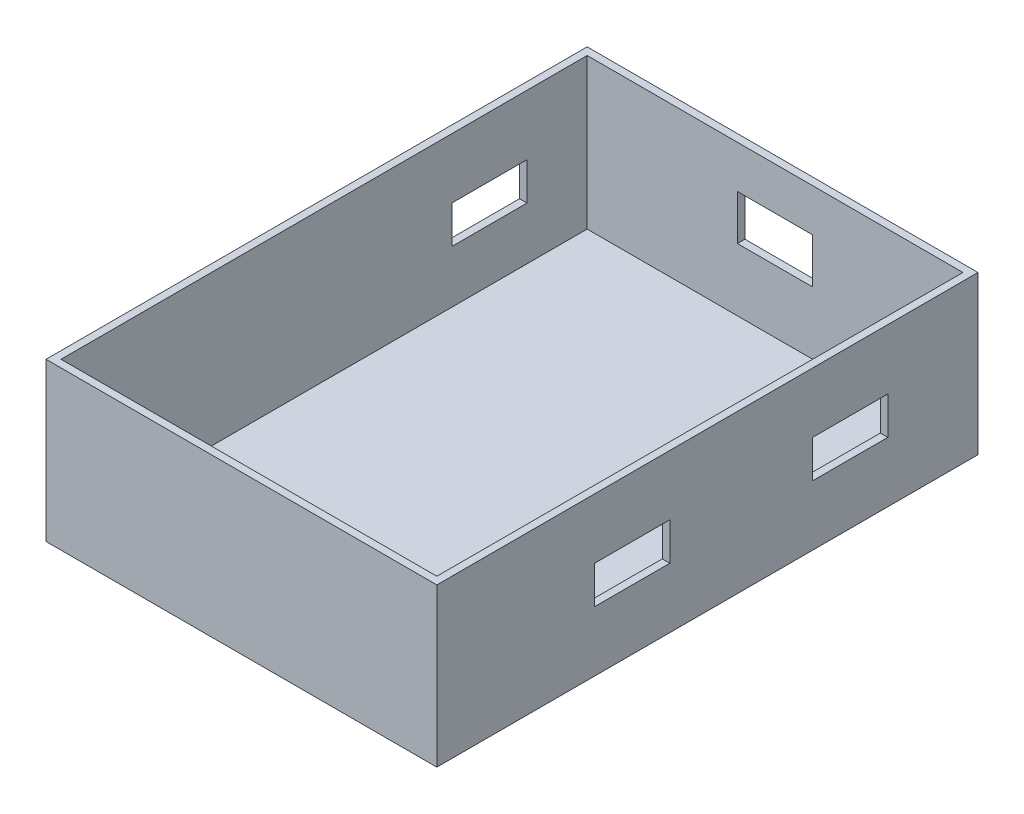
ISO-10303-21;
HEADER;
FILE_DESCRIPTION(('STEP AP214'),'2;1');
FILE_NAME('part.step','',(''),(''),'','','');
FILE_SCHEMA(('AUTOMOTIVE_DESIGN { 1 0 10303 214 1 1 1 1 }'));
ENDSEC;
DATA;
#1=APPLICATION_CONTEXT('core data for automotive mechanical design processes');
#2=APPLICATION_PROTOCOL_DEFINITION('international standard','automotive_design',2000,#1);
#3=PRODUCT_CONTEXT('',#1,'mechanical');
#4=PRODUCT('Part','Part','',(#3));
#5=PRODUCT_RELATED_PRODUCT_CATEGORY('part','',(#4));
#6=PRODUCT_DEFINITION_FORMATION('','',#4);
#7=PRODUCT_DEFINITION_CONTEXT('part definition',#1,'design');
#8=PRODUCT_DEFINITION('design','',#6,#7);
#9=PRODUCT_DEFINITION_SHAPE('','',#8);
#10=(LENGTH_UNIT() NAMED_UNIT(*) SI_UNIT(.MILLI.,.METRE.));
#11=(NAMED_UNIT(*) PLANE_ANGLE_UNIT() SI_UNIT($,.RADIAN.));
#12=(NAMED_UNIT(*) SI_UNIT($,.STERADIAN.) SOLID_ANGLE_UNIT());
#13=UNCERTAINTY_MEASURE_WITH_UNIT(LENGTH_MEASURE(1.E-05),#10,'distance_accuracy_value','');
#14=(GEOMETRIC_REPRESENTATION_CONTEXT(3) GLOBAL_UNCERTAINTY_ASSIGNED_CONTEXT((#13)) GLOBAL_UNIT_ASSIGNED_CONTEXT((#10,
#11,#12)) REPRESENTATION_CONTEXT('',''));
#15=CARTESIAN_POINT('',(0.,0.,0.));
#16=DIRECTION('',(0.,0.,1.));
#17=DIRECTION('',(1.,0.,0.));
#18=AXIS2_PLACEMENT_3D('',#15,#16,#17);
#19=CARTESIAN_POINT('',(-1.,21.,1.));
#20=DIRECTION('',(1.,0.,0.));
#21=DIRECTION('',(0.,0.,-1.));
#22=AXIS2_PLACEMENT_3D('',#19,#20,#21);
#23=PLANE('',#22);
#24=DIRECTION('',(0.,0.,1.));
#25=VECTOR('',#24,1.);
#26=CARTESIAN_POINT('',(-1.,0.,1.));
#27=LINE('',#26,#25);
#28=CARTESIAN_POINT('',(-1.,0.,-71.));
#29=VERTEX_POINT('',#28);
#30=CARTESIAN_POINT('',(-1.,0.,1.));
#31=VERTEX_POINT('',#30);
#32=EDGE_CURVE('E371',#29,#31,#27,.T.);
#33=ORIENTED_EDGE('',*,*,#32,.T.);
#34=DIRECTION('',(0.,-1.,0.));
#35=VECTOR('',#34,1.);
#36=CARTESIAN_POINT('',(-1.,21.,1.));
#37=LINE('',#36,#35);
#38=CARTESIAN_POINT('',(-1.,21.,1.));
#39=VERTEX_POINT('',#38);
#40=EDGE_CURVE('E409',#39,#31,#37,.T.);
#41=ORIENTED_EDGE('',*,*,#40,.F.);
#42=DIRECTION('',(0.,0.,1.));
#43=VECTOR('',#42,1.);
#44=CARTESIAN_POINT('',(-1.,21.,1.));
#45=LINE('',#44,#43);
#46=CARTESIAN_POINT('',(-1.,21.,-71.));
#47=VERTEX_POINT('',#46);
#48=EDGE_CURVE('E372',#47,#39,#45,.T.);
#49=ORIENTED_EDGE('',*,*,#48,.F.);
#50=DIRECTION('',(0.,-1.,0.));
#51=VECTOR('',#50,1.);
#52=CARTESIAN_POINT('',(-1.,21.,-71.));
#53=LINE('',#52,#51);
#54=EDGE_CURVE('E386',#47,#29,#53,.T.);
#55=ORIENTED_EDGE('',*,*,#54,.T.);
#56=EDGE_LOOP('',(#33,#41,#49,#55));
#57=FACE_BOUND('',#56,.T.);
#58=DIRECTION('',(0.,-1.,0.));
#59=VECTOR('',#58,1.);
#60=CARTESIAN_POINT('',(-1.,0.,-52.));
#61=LINE('',#60,#59);
#62=CARTESIAN_POINT('',(-1.,13.,-52.));
#63=VERTEX_POINT('',#62);
#64=CARTESIAN_POINT('',(-1.,8.,-52.));
#65=VERTEX_POINT('',#64);
#66=EDGE_CURVE('E237',#63,#65,#61,.T.);
#67=ORIENTED_EDGE('',*,*,#66,.T.);
#68=DIRECTION('',(0.,0.,1.));
#69=VECTOR('',#68,1.);
#70=CARTESIAN_POINT('',(-1.,8.,-62.));
#71=LINE('',#70,#69);
#72=CARTESIAN_POINT('',(-1.,8.,-62.));
#73=VERTEX_POINT('',#72);
#74=EDGE_CURVE('E252',#73,#65,#71,.T.);
#75=ORIENTED_EDGE('',*,*,#74,.F.);
#76=DIRECTION('',(0.,-1.,0.));
#77=VECTOR('',#76,1.);
#78=CARTESIAN_POINT('',(-1.,0.,-62.));
#79=LINE('',#78,#77);
#80=CARTESIAN_POINT('',(-1.,13.,-62.));
#81=VERTEX_POINT('',#80);
#82=EDGE_CURVE('E78',#81,#73,#79,.T.);
#83=ORIENTED_EDGE('',*,*,#82,.F.);
#84=DIRECTION('',(0.,0.,1.));
#85=VECTOR('',#84,1.);
#86=CARTESIAN_POINT('',(-1.,13.,0.));
#87=LINE('',#86,#85);
#88=EDGE_CURVE('E230',#81,#63,#87,.T.);
#89=ORIENTED_EDGE('',*,*,#88,.T.);
#90=EDGE_LOOP('',(#67,#75,#83,#89));
#91=FACE_BOUND('',#90,.T.);
#92=ADVANCED_FACE('F62',(#57,#91),#23,.F.);
#93=CARTESIAN_POINT('',(0.,21.,0.));
#94=DIRECTION('',(1.,0.,0.));
#95=DIRECTION('',(0.,0.,-1.));
#96=AXIS2_PLACEMENT_3D('',#93,#94,#95);
#97=PLANE('',#96);
#98=DIRECTION('',(0.,-1.,0.));
#99=VECTOR('',#98,1.);
#100=CARTESIAN_POINT('',(0.,21.,0.));
#101=LINE('',#100,#99);
#102=CARTESIAN_POINT('',(0.,21.,0.));
#103=VERTEX_POINT('',#102);
#104=CARTESIAN_POINT('',(0.,1.,0.));
#105=VERTEX_POINT('',#104);
#106=EDGE_CURVE('E367',#103,#105,#101,.T.);
#107=ORIENTED_EDGE('',*,*,#106,.T.);
#108=DIRECTION('',(0.,0.,-1.));
#109=VECTOR('',#108,1.);
#110=CARTESIAN_POINT('',(0.,1.,0.));
#111=LINE('',#110,#109);
#112=CARTESIAN_POINT('',(0.,1.,-70.));
#113=VERTEX_POINT('',#112);
#114=EDGE_CURVE('E423',#105,#113,#111,.T.);
#115=ORIENTED_EDGE('',*,*,#114,.T.);
#116=DIRECTION('',(0.,-1.,0.));
#117=VECTOR('',#116,1.);
#118=CARTESIAN_POINT('',(0.,21.,-70.));
#119=LINE('',#118,#117);
#120=CARTESIAN_POINT('',(0.,21.,-70.));
#121=VERTEX_POINT('',#120);
#122=EDGE_CURVE('E355',#121,#113,#119,.T.);
#123=ORIENTED_EDGE('',*,*,#122,.F.);
#124=DIRECTION('',(0.,0.,1.));
#125=VECTOR('',#124,1.);
#126=CARTESIAN_POINT('',(0.,21.,0.));
#127=LINE('',#126,#125);
#128=EDGE_CURVE('E333',#121,#103,#127,.T.);
#129=ORIENTED_EDGE('',*,*,#128,.T.);
#130=EDGE_LOOP('',(#107,#115,#123,#129));
#131=FACE_BOUND('',#130,.T.);
#132=DIRECTION('',(0.,0.,-1.));
#133=VECTOR('',#132,1.);
#134=CARTESIAN_POINT('',(0.,8.,0.));
#135=LINE('',#134,#133);
#136=CARTESIAN_POINT('',(0.,8.,-52.));
#137=VERTEX_POINT('',#136);
#138=CARTESIAN_POINT('',(0.,8.,-62.));
#139=VERTEX_POINT('',#138);
#140=EDGE_CURVE('E469',#137,#139,#135,.T.);
#141=ORIENTED_EDGE('',*,*,#140,.F.);
#142=DIRECTION('',(0.,1.,0.));
#143=VECTOR('',#142,1.);
#144=CARTESIAN_POINT('',(0.,21.,-52.));
#145=LINE('',#144,#143);
#146=CARTESIAN_POINT('',(0.,13.,-52.));
#147=VERTEX_POINT('',#146);
#148=EDGE_CURVE('E12',#137,#147,#145,.T.);
#149=ORIENTED_EDGE('',*,*,#148,.T.);
#150=DIRECTION('',(0.,0.,-1.));
#151=VECTOR('',#150,1.);
#152=CARTESIAN_POINT('',(0.,13.,0.));
#153=LINE('',#152,#151);
#154=CARTESIAN_POINT('',(0.,13.,-62.));
#155=VERTEX_POINT('',#154);
#156=EDGE_CURVE('E71',#147,#155,#153,.T.);
#157=ORIENTED_EDGE('',*,*,#156,.T.);
#158=DIRECTION('',(0.,1.,0.));
#159=VECTOR('',#158,1.);
#160=CARTESIAN_POINT('',(0.,21.,-62.));
#161=LINE('',#160,#159);
#162=EDGE_CURVE('E472',#139,#155,#161,.T.);
#163=ORIENTED_EDGE('',*,*,#162,.F.);
#164=EDGE_LOOP('',(#141,#149,#157,#163));
#165=FACE_BOUND('',#164,.T.);
#166=ADVANCED_FACE('F478',(#131,#165),#97,.T.);
#167=CARTESIAN_POINT('',(0.,1.,0.));
#168=DIRECTION('',(0.,1.,0.));
#169=DIRECTION('',(0.,0.,1.));
#170=AXIS2_PLACEMENT_3D('',#167,#168,#169);
#171=PLANE('',#170);
#172=DIRECTION('',(1.,0.,0.));
#173=VECTOR('',#172,1.);
#174=CARTESIAN_POINT('',(0.,1.,-70.));
#175=LINE('',#174,#173);
#176=CARTESIAN_POINT('',(50.,1.00000000000001,-70.));
#177=VERTEX_POINT('',#176);
#178=EDGE_CURVE('E413',#113,#177,#175,.T.);
#179=ORIENTED_EDGE('',*,*,#178,.F.);
#180=ORIENTED_EDGE('',*,*,#114,.F.);
#181=DIRECTION('',(1.,0.,0.));
#182=VECTOR('',#181,1.);
#183=CARTESIAN_POINT('',(0.,1.,0.));
#184=LINE('',#183,#182);
#185=CARTESIAN_POINT('',(50.,1.,0.));
#186=VERTEX_POINT('',#185);
#187=EDGE_CURVE('E420',#105,#186,#184,.T.);
#188=ORIENTED_EDGE('',*,*,#187,.T.);
#189=DIRECTION('',(0.,0.,-1.));
#190=VECTOR('',#189,1.);
#191=CARTESIAN_POINT('',(50.,1.,0.));
#192=LINE('',#191,#190);
#193=EDGE_CURVE('E417',#186,#177,#192,.T.);
#194=ORIENTED_EDGE('',*,*,#193,.T.);
#195=EDGE_LOOP('',(#179,#180,#188,#194));
#196=FACE_BOUND('',#195,.T.);
#197=ADVANCED_FACE('F496',(#196),#171,.T.);
#198=CARTESIAN_POINT('',(0.,21.,0.));
#199=DIRECTION('',(0.,-1.,0.));
#200=DIRECTION('',(0.,0.,-1.));
#201=AXIS2_PLACEMENT_3D('',#198,#199,#200);
#202=PLANE('',#201);
#203=ORIENTED_EDGE('',*,*,#48,.T.);
#204=DIRECTION('',(1.,0.,0.));
#205=VECTOR('',#204,1.);
#206=CARTESIAN_POINT('',(-1.,21.,1.));
#207=LINE('',#206,#205);
#208=CARTESIAN_POINT('',(51.,21.,1.));
#209=VERTEX_POINT('',#208);
#210=EDGE_CURVE('E376',#39,#209,#207,.T.);
#211=ORIENTED_EDGE('',*,*,#210,.T.);
#212=DIRECTION('',(0.,0.,-1.));
#213=VECTOR('',#212,1.);
#214=CARTESIAN_POINT('',(51.,21.,1.));
#215=LINE('',#214,#213);
#216=CARTESIAN_POINT('',(51.,21.,-71.));
#217=VERTEX_POINT('',#216);
#218=EDGE_CURVE('E380',#209,#217,#215,.T.);
#219=ORIENTED_EDGE('',*,*,#218,.T.);
#220=DIRECTION('',(-1.,0.,0.));
#221=VECTOR('',#220,1.);
#222=CARTESIAN_POINT('',(-1.,21.,-71.));
#223=LINE('',#222,#221);
#224=EDGE_CURVE('E383',#217,#47,#223,.T.);
#225=ORIENTED_EDGE('',*,*,#224,.T.);
#226=EDGE_LOOP('',(#203,#211,#219,#225));
#227=FACE_BOUND('',#226,.T.);
#228=ORIENTED_EDGE('',*,*,#128,.F.);
#229=DIRECTION('',(-1.,0.,0.));
#230=VECTOR('',#229,1.);
#231=CARTESIAN_POINT('',(0.,21.,-70.));
#232=LINE('',#231,#230);
#233=CARTESIAN_POINT('',(50.,21.,-70.));
#234=VERTEX_POINT('',#233);
#235=EDGE_CURVE('E352',#234,#121,#232,.T.);
#236=ORIENTED_EDGE('',*,*,#235,.F.);
#237=DIRECTION('',(0.,0.,-1.));
#238=VECTOR('',#237,1.);
#239=CARTESIAN_POINT('',(50.,21.,0.));
#240=LINE('',#239,#238);
#241=CARTESIAN_POINT('',(50.,21.,0.));
#242=VERTEX_POINT('',#241);
#243=EDGE_CURVE('E348',#242,#234,#240,.T.);
#244=ORIENTED_EDGE('',*,*,#243,.F.);
#245=DIRECTION('',(1.,0.,0.));
#246=VECTOR('',#245,1.);
#247=CARTESIAN_POINT('',(0.,21.,0.));
#248=LINE('',#247,#246);
#249=EDGE_CURVE('E345',#103,#242,#248,.T.);
#250=ORIENTED_EDGE('',*,*,#249,.F.);
#251=EDGE_LOOP('',(#228,#236,#244,#250));
#252=FACE_BOUND('',#251,.T.);
#253=ADVANCED_FACE('F503',(#227,#252),#202,.F.);
#254=CARTESIAN_POINT('',(-1.,21.,1.));
#255=DIRECTION('',(0.,0.,-1.));
#256=DIRECTION('',(-1.,0.,0.));
#257=AXIS2_PLACEMENT_3D('',#254,#255,#256);
#258=PLANE('',#257);
#259=DIRECTION('',(1.,0.,0.));
#260=VECTOR('',#259,1.);
#261=CARTESIAN_POINT('',(-1.,0.,1.));
#262=LINE('',#261,#260);
#263=CARTESIAN_POINT('',(51.,0.,1.));
#264=VERTEX_POINT('',#263);
#265=EDGE_CURVE('E390',#31,#264,#262,.T.);
#266=ORIENTED_EDGE('',*,*,#265,.T.);
#267=DIRECTION('',(0.,-1.,0.));
#268=VECTOR('',#267,1.);
#269=CARTESIAN_POINT('',(51.,21.,1.));
#270=LINE('',#269,#268);
#271=EDGE_CURVE('E405',#209,#264,#270,.T.);
#272=ORIENTED_EDGE('',*,*,#271,.F.);
#273=ORIENTED_EDGE('',*,*,#210,.F.);
#274=ORIENTED_EDGE('',*,*,#40,.T.);
#275=EDGE_LOOP('',(#266,#272,#273,#274));
#276=FACE_BOUND('',#275,.T.);
#277=ADVANCED_FACE('F500',(#276),#258,.F.);
#278=CARTESIAN_POINT('',(51.,21.,1.));
#279=DIRECTION('',(-1.,0.,0.));
#280=DIRECTION('',(0.,0.,1.));
#281=AXIS2_PLACEMENT_3D('',#278,#279,#280);
#282=PLANE('',#281);
#283=DIRECTION('',(0.,1.,0.));
#284=VECTOR('',#283,1.);
#285=CARTESIAN_POINT('',(51.,0.,-30.));
#286=LINE('',#285,#284);
#287=CARTESIAN_POINT('',(51.,8.,-30.));
#288=VERTEX_POINT('',#287);
#289=CARTESIAN_POINT('',(51.,13.,-30.));
#290=VERTEX_POINT('',#289);
#291=EDGE_CURVE('E262',#288,#290,#286,.T.);
#292=ORIENTED_EDGE('',*,*,#291,.F.);
#293=DIRECTION('',(0.,0.,-1.));
#294=VECTOR('',#293,1.);
#295=CARTESIAN_POINT('',(51.,8.,0.));
#296=LINE('',#295,#294);
#297=CARTESIAN_POINT('',(51.,8.,-20.));
#298=VERTEX_POINT('',#297);
#299=EDGE_CURVE('E259',#298,#288,#296,.T.);
#300=ORIENTED_EDGE('',*,*,#299,.F.);
#301=DIRECTION('',(0.,1.,0.));
#302=VECTOR('',#301,1.);
#303=CARTESIAN_POINT('',(51.,0.,-20.));
#304=LINE('',#303,#302);
#305=CARTESIAN_POINT('',(51.,13.,-20.));
#306=VERTEX_POINT('',#305);
#307=EDGE_CURVE('E271',#298,#306,#304,.T.);
#308=ORIENTED_EDGE('',*,*,#307,.T.);
#309=DIRECTION('',(0.,0.,-1.));
#310=VECTOR('',#309,1.);
#311=CARTESIAN_POINT('',(51.,13.,0.));
#312=LINE('',#311,#310);
#313=EDGE_CURVE('E267',#306,#290,#312,.T.);
#314=ORIENTED_EDGE('',*,*,#313,.T.);
#315=EDGE_LOOP('',(#292,#300,#308,#314));
#316=FACE_BOUND('',#315,.T.);
#317=DIRECTION('',(0.,1.,0.));
#318=VECTOR('',#317,1.);
#319=CARTESIAN_POINT('',(51.,0.,-59.));
#320=LINE('',#319,#318);
#321=CARTESIAN_POINT('',(51.,8.00000000000001,-59.));
#322=VERTEX_POINT('',#321);
#323=CARTESIAN_POINT('',(51.,13.,-59.));
#324=VERTEX_POINT('',#323);
#325=EDGE_CURVE('E291',#322,#324,#320,.T.);
#326=ORIENTED_EDGE('',*,*,#325,.F.);
#327=DIRECTION('',(0.,0.,-1.));
#328=VECTOR('',#327,1.);
#329=CARTESIAN_POINT('',(51.,8.00000000000001,0.));
#330=LINE('',#329,#328);
#331=CARTESIAN_POINT('',(51.,8.00000000000001,-49.));
#332=VERTEX_POINT('',#331);
#333=EDGE_CURVE('E250',#332,#322,#330,.T.);
#334=ORIENTED_EDGE('',*,*,#333,.F.);
#335=DIRECTION('',(0.,1.,0.));
#336=VECTOR('',#335,1.);
#337=CARTESIAN_POINT('',(51.,0.,-49.));
#338=LINE('',#337,#336);
#339=CARTESIAN_POINT('',(51.,13.,-49.));
#340=VERTEX_POINT('',#339);
#341=EDGE_CURVE('E299',#332,#340,#338,.T.);
#342=ORIENTED_EDGE('',*,*,#341,.T.);
#343=DIRECTION('',(0.,0.,-1.));
#344=VECTOR('',#343,1.);
#345=CARTESIAN_POINT('',(51.,13.,0.));
#346=LINE('',#345,#344);
#347=EDGE_CURVE('E295',#340,#324,#346,.T.);
#348=ORIENTED_EDGE('',*,*,#347,.T.);
#349=EDGE_LOOP('',(#326,#334,#342,#348));
#350=FACE_BOUND('',#349,.T.);
#351=DIRECTION('',(0.,0.,-1.));
#352=VECTOR('',#351,1.);
#353=CARTESIAN_POINT('',(51.,0.,1.));
#354=LINE('',#353,#352);
#355=CARTESIAN_POINT('',(51.,0.,-71.));
#356=VERTEX_POINT('',#355);
#357=EDGE_CURVE('E393',#264,#356,#354,.T.);
#358=ORIENTED_EDGE('',*,*,#357,.T.);
#359=DIRECTION('',(0.,-1.,0.));
#360=VECTOR('',#359,1.);
#361=CARTESIAN_POINT('',(51.,21.,-71.));
#362=LINE('',#361,#360);
#363=EDGE_CURVE('E401',#217,#356,#362,.T.);
#364=ORIENTED_EDGE('',*,*,#363,.F.);
#365=ORIENTED_EDGE('',*,*,#218,.F.);
#366=ORIENTED_EDGE('',*,*,#271,.T.);
#367=EDGE_LOOP('',(#358,#364,#365,#366));
#368=FACE_BOUND('',#367,.T.);
#369=ADVANCED_FACE('F544',(#316,#350,#368),#282,.F.);
#370=CARTESIAN_POINT('',(-1.,21.,-71.));
#371=DIRECTION('',(0.,0.,1.));
#372=DIRECTION('',(1.,0.,0.));
#373=AXIS2_PLACEMENT_3D('',#370,#371,#372);
#374=PLANE('',#373);
#375=DIRECTION('',(-1.,0.,0.));
#376=VECTOR('',#375,1.);
#377=CARTESIAN_POINT('',(0.,9.33,-71.));
#378=LINE('',#377,#376);
#379=CARTESIAN_POINT('',(30.,9.33,-71.));
#380=VERTEX_POINT('',#379);
#381=CARTESIAN_POINT('',(20.,9.33,-71.));
#382=VERTEX_POINT('',#381);
#383=EDGE_CURVE('E317',#380,#382,#378,.T.);
#384=ORIENTED_EDGE('',*,*,#383,.F.);
#385=DIRECTION('',(0.,-1.,0.));
#386=VECTOR('',#385,1.);
#387=CARTESIAN_POINT('',(30.,0.,-71.));
#388=LINE('',#387,#386);
#389=CARTESIAN_POINT('',(30.,15.33,-71.));
#390=VERTEX_POINT('',#389);
#391=EDGE_CURVE('E279',#390,#380,#388,.T.);
#392=ORIENTED_EDGE('',*,*,#391,.F.);
#393=DIRECTION('',(-1.,0.,0.));
#394=VECTOR('',#393,1.);
#395=CARTESIAN_POINT('',(0.,15.33,-71.));
#396=LINE('',#395,#394);
#397=CARTESIAN_POINT('',(20.,15.33,-71.));
#398=VERTEX_POINT('',#397);
#399=EDGE_CURVE('E325',#390,#398,#396,.T.);
#400=ORIENTED_EDGE('',*,*,#399,.T.);
#401=DIRECTION('',(0.,-1.,0.));
#402=VECTOR('',#401,1.);
#403=CARTESIAN_POINT('',(20.,0.,-71.));
#404=LINE('',#403,#402);
#405=EDGE_CURVE('E321',#398,#382,#404,.T.);
#406=ORIENTED_EDGE('',*,*,#405,.T.);
#407=EDGE_LOOP('',(#384,#392,#400,#406));
#408=FACE_BOUND('',#407,.T.);
#409=DIRECTION('',(-1.,0.,0.));
#410=VECTOR('',#409,1.);
#411=CARTESIAN_POINT('',(-1.,0.,-71.));
#412=LINE('',#411,#410);
#413=EDGE_CURVE('E377',#356,#29,#412,.T.);
#414=ORIENTED_EDGE('',*,*,#413,.T.);
#415=ORIENTED_EDGE('',*,*,#54,.F.);
#416=ORIENTED_EDGE('',*,*,#224,.F.);
#417=ORIENTED_EDGE('',*,*,#363,.T.);
#418=EDGE_LOOP('',(#414,#415,#416,#417));
#419=FACE_BOUND('',#418,.T.);
#420=ADVANCED_FACE('F537',(#408,#419),#374,.F.);
#421=CARTESIAN_POINT('',(0.,21.,0.));
#422=DIRECTION('',(0.,0.,-1.));
#423=DIRECTION('',(-1.,0.,0.));
#424=AXIS2_PLACEMENT_3D('',#421,#422,#423);
#425=PLANE('',#424);
#426=DIRECTION('',(0.,-1.,0.));
#427=VECTOR('',#426,1.);
#428=CARTESIAN_POINT('',(50.,21.,0.));
#429=LINE('',#428,#427);
#430=EDGE_CURVE('E363',#242,#186,#429,.T.);
#431=ORIENTED_EDGE('',*,*,#430,.T.);
#432=ORIENTED_EDGE('',*,*,#187,.F.);
#433=ORIENTED_EDGE('',*,*,#106,.F.);
#434=ORIENTED_EDGE('',*,*,#249,.T.);
#435=EDGE_LOOP('',(#431,#432,#433,#434));
#436=FACE_BOUND('',#435,.T.);
#437=ADVANCED_FACE('F522',(#436),#425,.T.);
#438=CARTESIAN_POINT('',(50.,21.,0.));
#439=DIRECTION('',(-1.,0.,0.));
#440=DIRECTION('',(0.,0.,1.));
#441=AXIS2_PLACEMENT_3D('',#438,#439,#440);
#442=PLANE('',#441);
#443=DIRECTION('',(0.,0.,1.));
#444=VECTOR('',#443,1.);
#445=CARTESIAN_POINT('',(50.,8.,0.));
#446=LINE('',#445,#444);
#447=CARTESIAN_POINT('',(50.,8.,-30.));
#448=VERTEX_POINT('',#447);
#449=CARTESIAN_POINT('',(50.,8.,-20.));
#450=VERTEX_POINT('',#449);
#451=EDGE_CURVE('E466',#448,#450,#446,.T.);
#452=ORIENTED_EDGE('',*,*,#451,.F.);
#453=DIRECTION('',(0.,-1.,0.));
#454=VECTOR('',#453,1.);
#455=CARTESIAN_POINT('',(50.,21.,-30.));
#456=LINE('',#455,#454);
#457=CARTESIAN_POINT('',(50.,13.,-30.));
#458=VERTEX_POINT('',#457);
#459=EDGE_CURVE('E455',#458,#448,#456,.T.);
#460=ORIENTED_EDGE('',*,*,#459,.F.);
#461=DIRECTION('',(0.,0.,1.));
#462=VECTOR('',#461,1.);
#463=CARTESIAN_POINT('',(50.,13.,0.));
#464=LINE('',#463,#462);
#465=CARTESIAN_POINT('',(50.,13.,-20.));
#466=VERTEX_POINT('',#465);
#467=EDGE_CURVE('E458',#458,#466,#464,.T.);
#468=ORIENTED_EDGE('',*,*,#467,.T.);
#469=DIRECTION('',(0.,-1.,0.));
#470=VECTOR('',#469,1.);
#471=CARTESIAN_POINT('',(50.,21.,-20.));
#472=LINE('',#471,#470);
#473=EDGE_CURVE('E462',#466,#450,#472,.T.);
#474=ORIENTED_EDGE('',*,*,#473,.T.);
#475=EDGE_LOOP('',(#452,#460,#468,#474));
#476=FACE_BOUND('',#475,.T.);
#477=DIRECTION('',(0.,0.,1.));
#478=VECTOR('',#477,1.);
#479=CARTESIAN_POINT('',(50.,8.00000000000001,0.));
#480=LINE('',#479,#478);
#481=CARTESIAN_POINT('',(50.,8.00000000000001,-59.));
#482=VERTEX_POINT('',#481);
#483=CARTESIAN_POINT('',(50.,8.00000000000001,-49.));
#484=VERTEX_POINT('',#483);
#485=EDGE_CURVE('E452',#482,#484,#480,.T.);
#486=ORIENTED_EDGE('',*,*,#485,.F.);
#487=DIRECTION('',(0.,-1.,0.));
#488=VECTOR('',#487,1.);
#489=CARTESIAN_POINT('',(50.,21.,-59.));
#490=LINE('',#489,#488);
#491=CARTESIAN_POINT('',(50.,13.,-59.));
#492=VERTEX_POINT('',#491);
#493=EDGE_CURVE('E441',#492,#482,#490,.T.);
#494=ORIENTED_EDGE('',*,*,#493,.F.);
#495=DIRECTION('',(0.,0.,1.));
#496=VECTOR('',#495,1.);
#497=CARTESIAN_POINT('',(50.,13.,0.));
#498=LINE('',#497,#496);
#499=CARTESIAN_POINT('',(50.,13.,-49.));
#500=VERTEX_POINT('',#499);
#501=EDGE_CURVE('E444',#492,#500,#498,.T.);
#502=ORIENTED_EDGE('',*,*,#501,.T.);
#503=DIRECTION('',(0.,-1.,0.));
#504=VECTOR('',#503,1.);
#505=CARTESIAN_POINT('',(50.,21.,-49.));
#506=LINE('',#505,#504);
#507=EDGE_CURVE('E448',#500,#484,#506,.T.);
#508=ORIENTED_EDGE('',*,*,#507,.T.);
#509=EDGE_LOOP('',(#486,#494,#502,#508));
#510=FACE_BOUND('',#509,.T.);
#511=DIRECTION('',(0.,-1.,0.));
#512=VECTOR('',#511,1.);
#513=CARTESIAN_POINT('',(50.,21.,-70.));
#514=LINE('',#513,#512);
#515=EDGE_CURVE('E359',#234,#177,#514,.T.);
#516=ORIENTED_EDGE('',*,*,#515,.T.);
#517=ORIENTED_EDGE('',*,*,#193,.F.);
#518=ORIENTED_EDGE('',*,*,#430,.F.);
#519=ORIENTED_EDGE('',*,*,#243,.T.);
#520=EDGE_LOOP('',(#516,#517,#518,#519));
#521=FACE_BOUND('',#520,.T.);
#522=ADVANCED_FACE('F525',(#476,#510,#521),#442,.T.);
#523=CARTESIAN_POINT('',(0.,21.,-70.));
#524=DIRECTION('',(0.,0.,1.));
#525=DIRECTION('',(1.,0.,0.));
#526=AXIS2_PLACEMENT_3D('',#523,#524,#525);
#527=PLANE('',#526);
#528=DIRECTION('',(0.,1.,0.));
#529=VECTOR('',#528,1.);
#530=CARTESIAN_POINT('',(30.,21.,-70.));
#531=LINE('',#530,#529);
#532=CARTESIAN_POINT('',(30.,9.33,-70.));
#533=VERTEX_POINT('',#532);
#534=CARTESIAN_POINT('',(30.,15.33,-70.));
#535=VERTEX_POINT('',#534);
#536=EDGE_CURVE('E438',#533,#535,#531,.T.);
#537=ORIENTED_EDGE('',*,*,#536,.F.);
#538=DIRECTION('',(1.,0.,0.));
#539=VECTOR('',#538,1.);
#540=CARTESIAN_POINT('',(0.,9.33,-70.));
#541=LINE('',#540,#539);
#542=CARTESIAN_POINT('',(20.,9.33,-70.));
#543=VERTEX_POINT('',#542);
#544=EDGE_CURVE('E427',#543,#533,#541,.T.);
#545=ORIENTED_EDGE('',*,*,#544,.F.);
#546=DIRECTION('',(0.,1.,0.));
#547=VECTOR('',#546,1.);
#548=CARTESIAN_POINT('',(20.,21.,-70.));
#549=LINE('',#548,#547);
#550=CARTESIAN_POINT('',(20.,15.33,-70.));
#551=VERTEX_POINT('',#550);
#552=EDGE_CURVE('E430',#543,#551,#549,.T.);
#553=ORIENTED_EDGE('',*,*,#552,.T.);
#554=DIRECTION('',(1.,0.,0.));
#555=VECTOR('',#554,1.);
#556=CARTESIAN_POINT('',(0.,15.33,-70.));
#557=LINE('',#556,#555);
#558=EDGE_CURVE('E434',#551,#535,#557,.T.);
#559=ORIENTED_EDGE('',*,*,#558,.T.);
#560=EDGE_LOOP('',(#537,#545,#553,#559));
#561=FACE_BOUND('',#560,.T.);
#562=ORIENTED_EDGE('',*,*,#122,.T.);
#563=ORIENTED_EDGE('',*,*,#178,.T.);
#564=ORIENTED_EDGE('',*,*,#515,.F.);
#565=ORIENTED_EDGE('',*,*,#235,.T.);
#566=EDGE_LOOP('',(#562,#563,#564,#565));
#567=FACE_BOUND('',#566,.T.);
#568=ADVANCED_FACE('F516',(#561,#567),#527,.T.);
#569=CARTESIAN_POINT('',(0.,0.,0.));
#570=DIRECTION('',(0.,1.,0.));
#571=DIRECTION('',(0.,0.,1.));
#572=AXIS2_PLACEMENT_3D('',#569,#570,#571);
#573=PLANE('',#572);
#574=ORIENTED_EDGE('',*,*,#32,.F.);
#575=ORIENTED_EDGE('',*,*,#413,.F.);
#576=ORIENTED_EDGE('',*,*,#357,.F.);
#577=ORIENTED_EDGE('',*,*,#265,.F.);
#578=EDGE_LOOP('',(#574,#575,#576,#577));
#579=FACE_BOUND('',#578,.T.);
#580=ADVANCED_FACE('F64',(#579),#573,.F.);
#581=CARTESIAN_POINT('',(30.,0.,-50.));
#582=DIRECTION('',(1.,0.,0.));
#583=DIRECTION('',(0.,0.,-1.));
#584=AXIS2_PLACEMENT_3D('',#581,#582,#583);
#585=PLANE('',#584);
#586=ORIENTED_EDGE('',*,*,#536,.T.);
#587=DIRECTION('',(0.,0.,-1.));
#588=VECTOR('',#587,1.);
#589=CARTESIAN_POINT('',(30.,15.33,-50.));
#590=LINE('',#589,#588);
#591=EDGE_CURVE('E330',#535,#390,#590,.T.);
#592=ORIENTED_EDGE('',*,*,#591,.T.);
#593=ORIENTED_EDGE('',*,*,#391,.T.);
#594=DIRECTION('',(0.,0.,-1.));
#595=VECTOR('',#594,1.);
#596=CARTESIAN_POINT('',(30.,9.33,-50.));
#597=LINE('',#596,#595);
#598=EDGE_CURVE('E329',#533,#380,#597,.T.);
#599=ORIENTED_EDGE('',*,*,#598,.F.);
#600=EDGE_LOOP('',(#586,#592,#593,#599));
#601=FACE_BOUND('',#600,.T.);
#602=ADVANCED_FACE('F571',(#601),#585,.F.);
#603=CARTESIAN_POINT('',(0.,15.33,-50.));
#604=DIRECTION('',(0.,-1.,0.));
#605=DIRECTION('',(0.,0.,-1.));
#606=AXIS2_PLACEMENT_3D('',#603,#604,#605);
#607=PLANE('',#606);
#608=DIRECTION('',(0.,0.,-1.));
#609=VECTOR('',#608,1.);
#610=CARTESIAN_POINT('',(20.,15.33,-50.));
#611=LINE('',#610,#609);
#612=EDGE_CURVE('E334',#551,#398,#611,.T.);
#613=ORIENTED_EDGE('',*,*,#612,.T.);
#614=ORIENTED_EDGE('',*,*,#399,.F.);
#615=ORIENTED_EDGE('',*,*,#591,.F.);
#616=ORIENTED_EDGE('',*,*,#558,.F.);
#617=EDGE_LOOP('',(#613,#614,#615,#616));
#618=FACE_BOUND('',#617,.T.);
#619=ADVANCED_FACE('F577',(#618),#607,.T.);
#620=CARTESIAN_POINT('',(20.,0.,-50.));
#621=DIRECTION('',(1.,0.,0.));
#622=DIRECTION('',(0.,0.,-1.));
#623=AXIS2_PLACEMENT_3D('',#620,#621,#622);
#624=PLANE('',#623);
#625=DIRECTION('',(0.,0.,-1.));
#626=VECTOR('',#625,1.);
#627=CARTESIAN_POINT('',(20.,9.33,-50.));
#628=LINE('',#627,#626);
#629=EDGE_CURVE('E337',#543,#382,#628,.T.);
#630=ORIENTED_EDGE('',*,*,#629,.T.);
#631=ORIENTED_EDGE('',*,*,#405,.F.);
#632=ORIENTED_EDGE('',*,*,#612,.F.);
#633=ORIENTED_EDGE('',*,*,#552,.F.);
#634=EDGE_LOOP('',(#630,#631,#632,#633));
#635=FACE_BOUND('',#634,.T.);
#636=ADVANCED_FACE('F583',(#635),#624,.T.);
#637=CARTESIAN_POINT('',(0.,9.33,-50.));
#638=DIRECTION('',(0.,-1.,0.));
#639=DIRECTION('',(0.,0.,-1.));
#640=AXIS2_PLACEMENT_3D('',#637,#638,#639);
#641=PLANE('',#640);
#642=ORIENTED_EDGE('',*,*,#544,.T.);
#643=ORIENTED_EDGE('',*,*,#598,.T.);
#644=ORIENTED_EDGE('',*,*,#383,.T.);
#645=ORIENTED_EDGE('',*,*,#629,.F.);
#646=EDGE_LOOP('',(#642,#643,#644,#645));
#647=FACE_BOUND('',#646,.T.);
#648=ADVANCED_FACE('F587',(#647),#641,.F.);
#649=CARTESIAN_POINT('',(22.,8.00000000000001,0.));
#650=DIRECTION('',(0.,-1.,0.));
#651=DIRECTION('',(0.,0.,-1.));
#652=AXIS2_PLACEMENT_3D('',#649,#650,#651);
#653=PLANE('',#652);
#654=ORIENTED_EDGE('',*,*,#485,.T.);
#655=DIRECTION('',(1.,0.,0.));
#656=VECTOR('',#655,1.);
#657=CARTESIAN_POINT('',(22.,8.00000000000001,-49.));
#658=LINE('',#657,#656);
#659=EDGE_CURVE('E263',#484,#332,#658,.T.);
#660=ORIENTED_EDGE('',*,*,#659,.T.);
#661=ORIENTED_EDGE('',*,*,#333,.T.);
#662=DIRECTION('',(1.,0.,0.));
#663=VECTOR('',#662,1.);
#664=CARTESIAN_POINT('',(22.,8.00000000000001,-59.));
#665=LINE('',#664,#663);
#666=EDGE_CURVE('E303',#482,#322,#665,.T.);
#667=ORIENTED_EDGE('',*,*,#666,.F.);
#668=EDGE_LOOP('',(#654,#660,#661,#667));
#669=FACE_BOUND('',#668,.T.);
#670=ADVANCED_FACE('F590',(#669),#653,.F.);
#671=CARTESIAN_POINT('',(22.,0.,-49.));
#672=DIRECTION('',(0.,0.,-1.));
#673=DIRECTION('',(-1.,0.,0.));
#674=AXIS2_PLACEMENT_3D('',#671,#672,#673);
#675=PLANE('',#674);
#676=DIRECTION('',(1.,0.,0.));
#677=VECTOR('',#676,1.);
#678=CARTESIAN_POINT('',(22.,13.,-49.));
#679=LINE('',#678,#677);
#680=EDGE_CURVE('E306',#500,#340,#679,.T.);
#681=ORIENTED_EDGE('',*,*,#680,.T.);
#682=ORIENTED_EDGE('',*,*,#341,.F.);
#683=ORIENTED_EDGE('',*,*,#659,.F.);
#684=ORIENTED_EDGE('',*,*,#507,.F.);
#685=EDGE_LOOP('',(#681,#682,#683,#684));
#686=FACE_BOUND('',#685,.T.);
#687=ADVANCED_FACE('F597',(#686),#675,.T.);
#688=CARTESIAN_POINT('',(22.,13.,0.));
#689=DIRECTION('',(0.,-1.,0.));
#690=DIRECTION('',(0.,0.,-1.));
#691=AXIS2_PLACEMENT_3D('',#688,#689,#690);
#692=PLANE('',#691);
#693=DIRECTION('',(1.,0.,0.));
#694=VECTOR('',#693,1.);
#695=CARTESIAN_POINT('',(22.,13.,-59.));
#696=LINE('',#695,#694);
#697=EDGE_CURVE('E309',#492,#324,#696,.T.);
#698=ORIENTED_EDGE('',*,*,#697,.T.);
#699=ORIENTED_EDGE('',*,*,#347,.F.);
#700=ORIENTED_EDGE('',*,*,#680,.F.);
#701=ORIENTED_EDGE('',*,*,#501,.F.);
#702=EDGE_LOOP('',(#698,#699,#700,#701));
#703=FACE_BOUND('',#702,.T.);
#704=ADVANCED_FACE('F603',(#703),#692,.T.);
#705=CARTESIAN_POINT('',(22.,0.,-59.));
#706=DIRECTION('',(0.,0.,-1.));
#707=DIRECTION('',(-1.,0.,0.));
#708=AXIS2_PLACEMENT_3D('',#705,#706,#707);
#709=PLANE('',#708);
#710=ORIENTED_EDGE('',*,*,#493,.T.);
#711=ORIENTED_EDGE('',*,*,#666,.T.);
#712=ORIENTED_EDGE('',*,*,#325,.T.);
#713=ORIENTED_EDGE('',*,*,#697,.F.);
#714=EDGE_LOOP('',(#710,#711,#712,#713));
#715=FACE_BOUND('',#714,.T.);
#716=ADVANCED_FACE('F599',(#715),#709,.F.);
#717=CARTESIAN_POINT('',(22.,8.,0.));
#718=DIRECTION('',(0.,-1.,0.));
#719=DIRECTION('',(0.,0.,-1.));
#720=AXIS2_PLACEMENT_3D('',#717,#718,#719);
#721=PLANE('',#720);
#722=ORIENTED_EDGE('',*,*,#451,.T.);
#723=DIRECTION('',(1.,0.,0.));
#724=VECTOR('',#723,1.);
#725=CARTESIAN_POINT('',(22.,8.,-20.));
#726=LINE('',#725,#724);
#727=EDGE_CURVE('E276',#450,#298,#726,.T.);
#728=ORIENTED_EDGE('',*,*,#727,.T.);
#729=ORIENTED_EDGE('',*,*,#299,.T.);
#730=DIRECTION('',(1.,0.,0.));
#731=VECTOR('',#730,1.);
#732=CARTESIAN_POINT('',(22.,8.,-30.));
#733=LINE('',#732,#731);
#734=EDGE_CURVE('E275',#448,#288,#733,.T.);
#735=ORIENTED_EDGE('',*,*,#734,.F.);
#736=EDGE_LOOP('',(#722,#728,#729,#735));
#737=FACE_BOUND('',#736,.T.);
#738=ADVANCED_FACE('F602',(#737),#721,.F.);
#739=CARTESIAN_POINT('',(22.,0.,-20.));
#740=DIRECTION('',(0.,0.,-1.));
#741=DIRECTION('',(-1.,0.,0.));
#742=AXIS2_PLACEMENT_3D('',#739,#740,#741);
#743=PLANE('',#742);
#744=DIRECTION('',(1.,0.,0.));
#745=VECTOR('',#744,1.);
#746=CARTESIAN_POINT('',(22.,13.,-20.));
#747=LINE('',#746,#745);
#748=EDGE_CURVE('E280',#466,#306,#747,.T.);
#749=ORIENTED_EDGE('',*,*,#748,.T.);
#750=ORIENTED_EDGE('',*,*,#307,.F.);
#751=ORIENTED_EDGE('',*,*,#727,.F.);
#752=ORIENTED_EDGE('',*,*,#473,.F.);
#753=EDGE_LOOP('',(#749,#750,#751,#752));
#754=FACE_BOUND('',#753,.T.);
#755=ADVANCED_FACE('F613',(#754),#743,.T.);
#756=CARTESIAN_POINT('',(22.,13.,0.));
#757=DIRECTION('',(0.,-1.,0.));
#758=DIRECTION('',(0.,0.,-1.));
#759=AXIS2_PLACEMENT_3D('',#756,#757,#758);
#760=PLANE('',#759);
#761=DIRECTION('',(1.,0.,0.));
#762=VECTOR('',#761,1.);
#763=CARTESIAN_POINT('',(22.,13.,-30.));
#764=LINE('',#763,#762);
#765=EDGE_CURVE('E283',#458,#290,#764,.T.);
#766=ORIENTED_EDGE('',*,*,#765,.T.);
#767=ORIENTED_EDGE('',*,*,#313,.F.);
#768=ORIENTED_EDGE('',*,*,#748,.F.);
#769=ORIENTED_EDGE('',*,*,#467,.F.);
#770=EDGE_LOOP('',(#766,#767,#768,#769));
#771=FACE_BOUND('',#770,.T.);
#772=ADVANCED_FACE('F618',(#771),#760,.T.);
#773=CARTESIAN_POINT('',(22.,0.,-30.));
#774=DIRECTION('',(0.,0.,-1.));
#775=DIRECTION('',(-1.,0.,0.));
#776=AXIS2_PLACEMENT_3D('',#773,#774,#775);
#777=PLANE('',#776);
#778=ORIENTED_EDGE('',*,*,#459,.T.);
#779=ORIENTED_EDGE('',*,*,#734,.T.);
#780=ORIENTED_EDGE('',*,*,#291,.T.);
#781=ORIENTED_EDGE('',*,*,#765,.F.);
#782=EDGE_LOOP('',(#778,#779,#780,#781));
#783=FACE_BOUND('',#782,.T.);
#784=ADVANCED_FACE('F615',(#783),#777,.F.);
#785=CARTESIAN_POINT('',(28.,0.,-52.));
#786=DIRECTION('',(0.,0.,-1.));
#787=DIRECTION('',(-1.,0.,0.));
#788=AXIS2_PLACEMENT_3D('',#785,#786,#787);
#789=PLANE('',#788);
#790=DIRECTION('',(-1.,0.,0.));
#791=VECTOR('',#790,1.);
#792=CARTESIAN_POINT('',(28.,8.,-52.));
#793=LINE('',#792,#791);
#794=EDGE_CURVE('E86',#137,#65,#793,.T.);
#795=ORIENTED_EDGE('',*,*,#794,.T.);
#796=ORIENTED_EDGE('',*,*,#66,.F.);
#797=DIRECTION('',(-1.,0.,0.));
#798=VECTOR('',#797,1.);
#799=CARTESIAN_POINT('',(28.,13.,-52.));
#800=LINE('',#799,#798);
#801=EDGE_CURVE('E225',#147,#63,#800,.T.);
#802=ORIENTED_EDGE('',*,*,#801,.F.);
#803=ORIENTED_EDGE('',*,*,#148,.F.);
#804=EDGE_LOOP('',(#795,#796,#802,#803));
#805=FACE_BOUND('',#804,.T.);
#806=ADVANCED_FACE('F238',(#805),#789,.T.);
#807=CARTESIAN_POINT('',(28.,13.,0.));
#808=DIRECTION('',(0.,-1.,0.));
#809=DIRECTION('',(0.,0.,-1.));
#810=AXIS2_PLACEMENT_3D('',#807,#808,#809);
#811=PLANE('',#810);
#812=ORIENTED_EDGE('',*,*,#801,.T.);
#813=ORIENTED_EDGE('',*,*,#88,.F.);
#814=DIRECTION('',(-1.,0.,0.));
#815=VECTOR('',#814,1.);
#816=CARTESIAN_POINT('',(28.,13.,-62.));
#817=LINE('',#816,#815);
#818=EDGE_CURVE('E234',#155,#81,#817,.T.);
#819=ORIENTED_EDGE('',*,*,#818,.F.);
#820=ORIENTED_EDGE('',*,*,#156,.F.);
#821=EDGE_LOOP('',(#812,#813,#819,#820));
#822=FACE_BOUND('',#821,.T.);
#823=ADVANCED_FACE('F227',(#822),#811,.T.);
#824=CARTESIAN_POINT('',(28.,0.,-62.));
#825=DIRECTION('',(0.,0.,-1.));
#826=DIRECTION('',(-1.,0.,0.));
#827=AXIS2_PLACEMENT_3D('',#824,#825,#826);
#828=PLANE('',#827);
#829=ORIENTED_EDGE('',*,*,#162,.T.);
#830=ORIENTED_EDGE('',*,*,#818,.T.);
#831=ORIENTED_EDGE('',*,*,#82,.T.);
#832=DIRECTION('',(-1.,0.,0.));
#833=VECTOR('',#832,1.);
#834=CARTESIAN_POINT('',(28.,8.,-62.));
#835=LINE('',#834,#833);
#836=EDGE_CURVE('E242',#139,#73,#835,.T.);
#837=ORIENTED_EDGE('',*,*,#836,.F.);
#838=EDGE_LOOP('',(#829,#830,#831,#837));
#839=FACE_BOUND('',#838,.T.);
#840=ADVANCED_FACE('F480',(#839),#828,.F.);
#841=CARTESIAN_POINT('',(28.,8.,-62.));
#842=DIRECTION('',(0.,-1.,0.));
#843=DIRECTION('',(0.,0.,-1.));
#844=AXIS2_PLACEMENT_3D('',#841,#842,#843);
#845=PLANE('',#844);
#846=ORIENTED_EDGE('',*,*,#140,.T.);
#847=ORIENTED_EDGE('',*,*,#836,.T.);
#848=ORIENTED_EDGE('',*,*,#74,.T.);
#849=ORIENTED_EDGE('',*,*,#794,.F.);
#850=EDGE_LOOP('',(#846,#847,#848,#849));
#851=FACE_BOUND('',#850,.T.);
#852=ADVANCED_FACE('F479',(#851),#845,.F.);
#853=CLOSED_SHELL('',(#92,#166,#197,#253,#277,#369,#420,#437,#522,#568,#580,#602,#619,#636,#648,
#670,#687,#704,#716,#738,#755,#772,#784,#806,#823,#840,#852));
#854=MANIFOLD_SOLID_BREP('B2',#853);
#855=ADVANCED_BREP_SHAPE_REPRESENTATION('',(#18,#854),#14);
#856=SHAPE_DEFINITION_REPRESENTATION(#9,#855);
ENDSEC;
END-ISO-10303-21;
